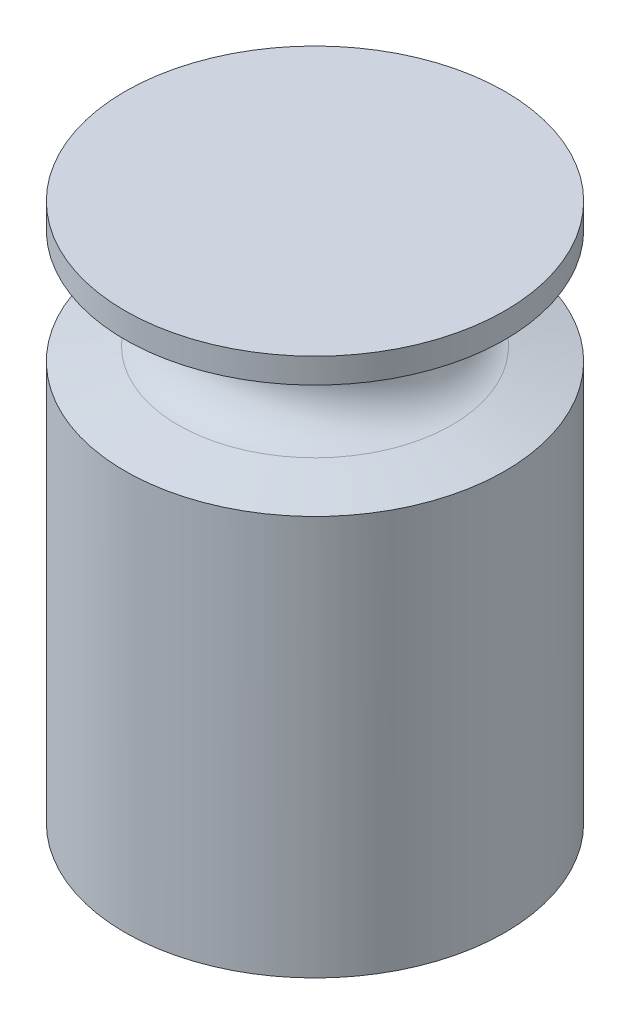
ISO-10303-21;
HEADER;
FILE_DESCRIPTION(('STEP AP214'),'2;1');
FILE_NAME('part.step','',(''),(''),'','','');
FILE_SCHEMA(('AUTOMOTIVE_DESIGN { 1 0 10303 214 1 1 1 1 }'));
ENDSEC;
DATA;
#1=APPLICATION_CONTEXT('core data for automotive mechanical design processes');
#2=APPLICATION_PROTOCOL_DEFINITION('international standard','automotive_design',2000,#1);
#3=PRODUCT_CONTEXT('',#1,'mechanical');
#4=PRODUCT('Part','Part','',(#3));
#5=PRODUCT_RELATED_PRODUCT_CATEGORY('part','',(#4));
#6=PRODUCT_DEFINITION_FORMATION('','',#4);
#7=PRODUCT_DEFINITION_CONTEXT('part definition',#1,'design');
#8=PRODUCT_DEFINITION('design','',#6,#7);
#9=PRODUCT_DEFINITION_SHAPE('','',#8);
#10=(LENGTH_UNIT() NAMED_UNIT(*) SI_UNIT(.MILLI.,.METRE.));
#11=(NAMED_UNIT(*) PLANE_ANGLE_UNIT() SI_UNIT($,.RADIAN.));
#12=(NAMED_UNIT(*) SI_UNIT($,.STERADIAN.) SOLID_ANGLE_UNIT());
#13=UNCERTAINTY_MEASURE_WITH_UNIT(LENGTH_MEASURE(1.E-05),#10,'distance_accuracy_value','');
#14=(GEOMETRIC_REPRESENTATION_CONTEXT(3) GLOBAL_UNCERTAINTY_ASSIGNED_CONTEXT((#13)) GLOBAL_UNIT_ASSIGNED_CONTEXT((#10,
#11,#12)) REPRESENTATION_CONTEXT('',''));
#15=CARTESIAN_POINT('',(0.,0.,0.));
#16=DIRECTION('',(0.,0.,1.));
#17=DIRECTION('',(1.,0.,0.));
#18=AXIS2_PLACEMENT_3D('',#15,#16,#17);
#19=CARTESIAN_POINT('',(0.,71.,0.));
#20=DIRECTION('',(0.,-1.,0.));
#21=DIRECTION('',(0.,0.,-1.));
#22=AXIS2_PLACEMENT_3D('',#19,#20,#21);
#23=CYLINDRICAL_SURFACE('',#22,25.05);
#24=CARTESIAN_POINT('',(0.,71.,0.));
#25=DIRECTION('',(0.,1.,0.));
#26=DIRECTION('',(0.,0.,1.));
#27=AXIS2_PLACEMENT_3D('',#24,#25,#26);
#28=CIRCLE('',#27,25.05);
#29=CARTESIAN_POINT('',(0.,71.,25.05));
#30=VERTEX_POINT('',#29);
#31=EDGE_CURVE('E10',#30,#30,#28,.T.);
#32=ORIENTED_EDGE('',*,*,#31,.F.);
#33=EDGE_LOOP('',(#32));
#34=FACE_BOUND('',#33,.T.);
#35=CARTESIAN_POINT('',(0.,67.7,0.));
#36=DIRECTION('',(0.,-1.,0.));
#37=DIRECTION('',(0.,0.,-1.));
#38=AXIS2_PLACEMENT_3D('',#35,#36,#37);
#39=CIRCLE('',#38,25.05);
#40=CARTESIAN_POINT('',(0.,67.7,-25.05));
#41=VERTEX_POINT('',#40);
#42=EDGE_CURVE('E46',#41,#41,#39,.T.);
#43=ORIENTED_EDGE('',*,*,#42,.F.);
#44=EDGE_LOOP('',(#43));
#45=FACE_BOUND('',#44,.T.);
#46=ADVANCED_FACE('F36',(#34,#45),#23,.T.);
#47=CARTESIAN_POINT('',(0.,71.,0.));
#48=DIRECTION('',(0.,1.,0.));
#49=DIRECTION('',(0.,0.,1.));
#50=AXIS2_PLACEMENT_3D('',#47,#48,#49);
#51=PLANE('',#50);
#52=ORIENTED_EDGE('',*,*,#31,.T.);
#53=EDGE_LOOP('',(#52));
#54=FACE_BOUND('',#53,.T.);
#55=ADVANCED_FACE('F77',(#54),#51,.T.);
#56=CARTESIAN_POINT('',(0.,65.953486298951,0.));
#57=DIRECTION('',(0.,1.,0.));
#58=DIRECTION('',(0.,0.,1.));
#59=AXIS2_PLACEMENT_3D('',#56,#57,#58);
#60=CONICAL_SURFACE('',#59,18.0451161476738,1.32645023151569);
#61=ORIENTED_EDGE('',*,*,#42,.T.);
#62=EDGE_LOOP('',(#61));
#63=FACE_BOUND('',#62,.T.);
#64=CARTESIAN_POINT('',(0.,65.953486298951,0.));
#65=DIRECTION('',(0.,-1.,0.));
#66=DIRECTION('',(0.,0.,-1.));
#67=AXIS2_PLACEMENT_3D('',#64,#65,#66);
#68=CIRCLE('',#67,18.0451161476738);
#69=CARTESIAN_POINT('',(0.,65.953486298951,-18.0451161476738));
#70=VERTEX_POINT('',#69);
#71=EDGE_CURVE('E50',#70,#70,#68,.T.);
#72=ORIENTED_EDGE('',*,*,#71,.F.);
#73=EDGE_LOOP('',(#72));
#74=FACE_BOUND('',#73,.T.);
#75=ADVANCED_FACE('F73',(#63,#74),#60,.T.);
#76=CARTESIAN_POINT('',(0.,60.2,0.));
#77=DIRECTION('',(0.,-1.,0.));
#78=DIRECTION('',(0.,0.,-1.));
#79=AXIS2_PLACEMENT_3D('',#76,#77,#78);
#80=TOROIDAL_SURFACE('',#79,19.4796213959769,5.92962139597688);
#81=ORIENTED_EDGE('',*,*,#71,.T.);
#82=EDGE_LOOP('',(#81));
#83=FACE_BOUND('',#82,.T.);
#84=CARTESIAN_POINT('',(0.,54.4465137010489,0.));
#85=DIRECTION('',(0.,-1.,0.));
#86=DIRECTION('',(0.,0.,-1.));
#87=AXIS2_PLACEMENT_3D('',#84,#85,#86);
#88=CIRCLE('',#87,18.0451161476738);
#89=CARTESIAN_POINT('',(0.,54.4465137010489,-18.0451161476738));
#90=VERTEX_POINT('',#89);
#91=EDGE_CURVE('E53',#90,#90,#88,.T.);
#92=ORIENTED_EDGE('',*,*,#91,.F.);
#93=EDGE_LOOP('',(#92));
#94=FACE_BOUND('',#93,.T.);
#95=ADVANCED_FACE('F65',(#83,#94),#80,.F.);
#96=CARTESIAN_POINT('',(0.,52.7,0.));
#97=DIRECTION('',(0.,-1.,0.));
#98=DIRECTION('',(0.,0.,-1.));
#99=AXIS2_PLACEMENT_3D('',#96,#97,#98);
#100=CONICAL_SURFACE('',#99,25.05,1.3264502315157);
#101=ORIENTED_EDGE('',*,*,#91,.T.);
#102=EDGE_LOOP('',(#101));
#103=FACE_BOUND('',#102,.T.);
#104=CARTESIAN_POINT('',(0.,52.7,0.));
#105=DIRECTION('',(0.,-1.,0.));
#106=DIRECTION('',(0.,0.,-1.));
#107=AXIS2_PLACEMENT_3D('',#104,#105,#106);
#108=CIRCLE('',#107,25.05);
#109=CARTESIAN_POINT('',(0.,52.7,-25.05));
#110=VERTEX_POINT('',#109);
#111=EDGE_CURVE('E56',#110,#110,#108,.T.);
#112=ORIENTED_EDGE('',*,*,#111,.F.);
#113=EDGE_LOOP('',(#112));
#114=FACE_BOUND('',#113,.T.);
#115=ADVANCED_FACE('F62',(#103,#114),#100,.T.);
#116=CARTESIAN_POINT('',(0.,0.,0.));
#117=DIRECTION('',(0.,1.,0.));
#118=DIRECTION('',(0.,0.,1.));
#119=AXIS2_PLACEMENT_3D('',#116,#117,#118);
#120=PLANE('',#119);
#121=CARTESIAN_POINT('',(0.,0.,0.));
#122=DIRECTION('',(0.,1.,0.));
#123=DIRECTION('',(0.,0.,1.));
#124=AXIS2_PLACEMENT_3D('',#121,#122,#123);
#125=CIRCLE('',#124,25.05);
#126=CARTESIAN_POINT('',(0.,0.,25.05));
#127=VERTEX_POINT('',#126);
#128=EDGE_CURVE('E39',#127,#127,#125,.T.);
#129=ORIENTED_EDGE('',*,*,#128,.F.);
#130=EDGE_LOOP('',(#129));
#131=FACE_BOUND('',#130,.T.);
#132=ADVANCED_FACE('F64',(#131),#120,.F.);
#133=ORIENTED_EDGE('',*,*,#128,.T.);
#134=EDGE_LOOP('',(#133));
#135=FACE_BOUND('',#134,.T.);
#136=ORIENTED_EDGE('',*,*,#111,.T.);
#137=EDGE_LOOP('',(#136));
#138=FACE_BOUND('',#137,.T.);
#139=ADVANCED_FACE('F60',(#135,#138),#23,.T.);
#140=CLOSED_SHELL('',(#46,#55,#75,#95,#115,#132,#139));
#141=MANIFOLD_SOLID_BREP('B2',#140);
#142=ADVANCED_BREP_SHAPE_REPRESENTATION('',(#18,#141),#14);
#143=SHAPE_DEFINITION_REPRESENTATION(#9,#142);
ENDSEC;
END-ISO-10303-21;
